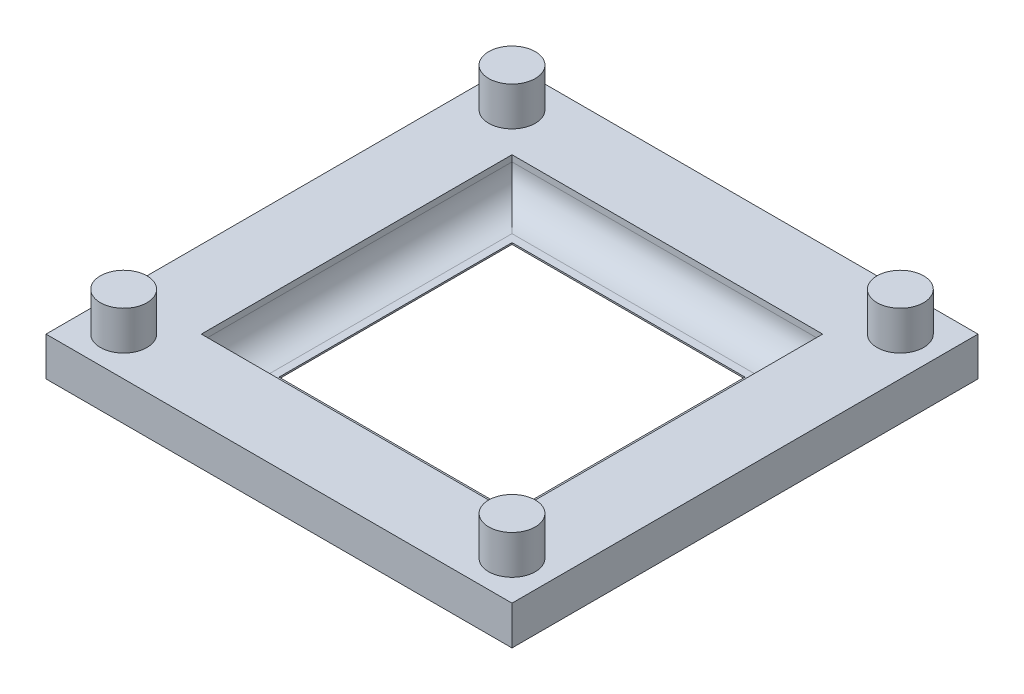
ISO-10303-21;
HEADER;
FILE_DESCRIPTION(('STEP AP214'),'2;1');
FILE_NAME('part.step','',(''),(''),'','','');
FILE_SCHEMA(('AUTOMOTIVE_DESIGN { 1 0 10303 214 1 1 1 1 }'));
ENDSEC;
DATA;
#1=APPLICATION_CONTEXT('core data for automotive mechanical design processes');
#2=APPLICATION_PROTOCOL_DEFINITION('international standard','automotive_design',2000,#1);
#3=PRODUCT_CONTEXT('',#1,'mechanical');
#4=PRODUCT('Part','Part','',(#3));
#5=PRODUCT_RELATED_PRODUCT_CATEGORY('part','',(#4));
#6=PRODUCT_DEFINITION_FORMATION('','',#4);
#7=PRODUCT_DEFINITION_CONTEXT('part definition',#1,'design');
#8=PRODUCT_DEFINITION('design','',#6,#7);
#9=PRODUCT_DEFINITION_SHAPE('','',#8);
#10=(LENGTH_UNIT() NAMED_UNIT(*) SI_UNIT(.MILLI.,.METRE.));
#11=(NAMED_UNIT(*) PLANE_ANGLE_UNIT() SI_UNIT($,.RADIAN.));
#12=(NAMED_UNIT(*) SI_UNIT($,.STERADIAN.) SOLID_ANGLE_UNIT());
#13=UNCERTAINTY_MEASURE_WITH_UNIT(LENGTH_MEASURE(1.E-05),#10,'distance_accuracy_value','');
#14=(GEOMETRIC_REPRESENTATION_CONTEXT(3) GLOBAL_UNCERTAINTY_ASSIGNED_CONTEXT((#13)) GLOBAL_UNIT_ASSIGNED_CONTEXT((#10,
#11,#12)) REPRESENTATION_CONTEXT('',''));
#15=CARTESIAN_POINT('',(0.,0.,0.));
#16=DIRECTION('',(0.,0.,1.));
#17=DIRECTION('',(1.,0.,0.));
#18=AXIS2_PLACEMENT_3D('',#15,#16,#17);
#19=CARTESIAN_POINT('',(7.5,0.1,0.));
#20=DIRECTION('',(-1.,0.,0.));
#21=DIRECTION('',(0.,0.,1.));
#22=AXIS2_PLACEMENT_3D('',#19,#20,#21);
#23=PLANE('',#22);
#24=DIRECTION('',(0.,0.,-1.));
#25=VECTOR('',#24,1.);
#26=CARTESIAN_POINT('',(7.5,0.,0.));
#27=LINE('',#26,#25);
#28=CARTESIAN_POINT('',(7.5,0.,7.5));
#29=VERTEX_POINT('',#28);
#30=CARTESIAN_POINT('',(7.5,0.,-7.5));
#31=VERTEX_POINT('',#30);
#32=EDGE_CURVE('E205',#29,#31,#27,.T.);
#33=ORIENTED_EDGE('',*,*,#32,.F.);
#34=DIRECTION('',(0.,-1.,0.));
#35=VECTOR('',#34,1.);
#36=CARTESIAN_POINT('',(7.5,0.1,7.5));
#37=LINE('',#36,#35);
#38=CARTESIAN_POINT('',(7.5,0.1,7.5));
#39=VERTEX_POINT('',#38);
#40=EDGE_CURVE('E237',#39,#29,#37,.T.);
#41=ORIENTED_EDGE('',*,*,#40,.F.);
#42=DIRECTION('',(0.,0.,-1.));
#43=VECTOR('',#42,1.);
#44=CARTESIAN_POINT('',(7.5,0.1,0.));
#45=LINE('',#44,#43);
#46=CARTESIAN_POINT('',(7.5,0.1,-7.5));
#47=VERTEX_POINT('',#46);
#48=EDGE_CURVE('E210',#39,#47,#45,.T.);
#49=ORIENTED_EDGE('',*,*,#48,.T.);
#50=DIRECTION('',(0.,-1.,0.));
#51=VECTOR('',#50,1.);
#52=CARTESIAN_POINT('',(7.5,0.1,-7.5));
#53=LINE('',#52,#51);
#54=EDGE_CURVE('E221',#47,#31,#53,.T.);
#55=ORIENTED_EDGE('',*,*,#54,.T.);
#56=EDGE_LOOP('',(#33,#41,#49,#55));
#57=FACE_BOUND('',#56,.T.);
#58=ADVANCED_FACE('F41',(#57),#23,.T.);
#59=CARTESIAN_POINT('',(0.,0.1,7.5));
#60=DIRECTION('',(0.,0.,-1.));
#61=DIRECTION('',(-1.,0.,0.));
#62=AXIS2_PLACEMENT_3D('',#59,#60,#61);
#63=PLANE('',#62);
#64=DIRECTION('',(1.,0.,0.));
#65=VECTOR('',#64,1.);
#66=CARTESIAN_POINT('',(0.,0.,7.5));
#67=LINE('',#66,#65);
#68=CARTESIAN_POINT('',(-7.5,0.,7.5));
#69=VERTEX_POINT('',#68);
#70=EDGE_CURVE('E224',#69,#29,#67,.T.);
#71=ORIENTED_EDGE('',*,*,#70,.F.);
#72=DIRECTION('',(0.,-1.,0.));
#73=VECTOR('',#72,1.);
#74=CARTESIAN_POINT('',(-7.5,0.1,7.5));
#75=LINE('',#74,#73);
#76=CARTESIAN_POINT('',(-7.5,0.1,7.5));
#77=VERTEX_POINT('',#76);
#78=EDGE_CURVE('E235',#77,#69,#75,.T.);
#79=ORIENTED_EDGE('',*,*,#78,.F.);
#80=DIRECTION('',(1.,0.,0.));
#81=VECTOR('',#80,1.);
#82=CARTESIAN_POINT('',(0.,0.1,7.5));
#83=LINE('',#82,#81);
#84=EDGE_CURVE('E213',#77,#39,#83,.T.);
#85=ORIENTED_EDGE('',*,*,#84,.T.);
#86=ORIENTED_EDGE('',*,*,#40,.T.);
#87=EDGE_LOOP('',(#71,#79,#85,#86));
#88=FACE_BOUND('',#87,.T.);
#89=ADVANCED_FACE('F289',(#88),#63,.T.);
#90=CARTESIAN_POINT('',(-7.5,0.1,0.));
#91=DIRECTION('',(-1.,0.,0.));
#92=DIRECTION('',(0.,0.,1.));
#93=AXIS2_PLACEMENT_3D('',#90,#91,#92);
#94=PLANE('',#93);
#95=DIRECTION('',(0.,0.,-1.));
#96=VECTOR('',#95,1.);
#97=CARTESIAN_POINT('',(-7.5,0.,0.));
#98=LINE('',#97,#96);
#99=CARTESIAN_POINT('',(-7.5,0.,-7.5));
#100=VERTEX_POINT('',#99);
#101=EDGE_CURVE('E227',#69,#100,#98,.T.);
#102=ORIENTED_EDGE('',*,*,#101,.T.);
#103=DIRECTION('',(0.,-1.,0.));
#104=VECTOR('',#103,1.);
#105=CARTESIAN_POINT('',(-7.5,0.1,-7.5));
#106=LINE('',#105,#104);
#107=CARTESIAN_POINT('',(-7.5,0.1,-7.5));
#108=VERTEX_POINT('',#107);
#109=EDGE_CURVE('E232',#108,#100,#106,.T.);
#110=ORIENTED_EDGE('',*,*,#109,.F.);
#111=DIRECTION('',(0.,0.,-1.));
#112=VECTOR('',#111,1.);
#113=CARTESIAN_POINT('',(-7.5,0.1,0.));
#114=LINE('',#113,#112);
#115=EDGE_CURVE('E217',#77,#108,#114,.T.);
#116=ORIENTED_EDGE('',*,*,#115,.F.);
#117=ORIENTED_EDGE('',*,*,#78,.T.);
#118=EDGE_LOOP('',(#102,#110,#116,#117));
#119=FACE_BOUND('',#118,.T.);
#120=ADVANCED_FACE('F295',(#119),#94,.F.);
#121=CARTESIAN_POINT('',(0.,0.1,-7.5));
#122=DIRECTION('',(0.,0.,-1.));
#123=DIRECTION('',(-1.,0.,0.));
#124=AXIS2_PLACEMENT_3D('',#121,#122,#123);
#125=PLANE('',#124);
#126=DIRECTION('',(1.,0.,0.));
#127=VECTOR('',#126,1.);
#128=CARTESIAN_POINT('',(0.,0.,-7.5));
#129=LINE('',#128,#127);
#130=EDGE_CURVE('E214',#100,#31,#129,.T.);
#131=ORIENTED_EDGE('',*,*,#130,.T.);
#132=ORIENTED_EDGE('',*,*,#54,.F.);
#133=DIRECTION('',(1.,0.,0.));
#134=VECTOR('',#133,1.);
#135=CARTESIAN_POINT('',(0.,0.1,-7.5));
#136=LINE('',#135,#134);
#137=EDGE_CURVE('E219',#108,#47,#136,.T.);
#138=ORIENTED_EDGE('',*,*,#137,.F.);
#139=ORIENTED_EDGE('',*,*,#109,.T.);
#140=EDGE_LOOP('',(#131,#132,#138,#139));
#141=FACE_BOUND('',#140,.T.);
#142=ADVANCED_FACE('F351',(#141),#125,.F.);
#143=CARTESIAN_POINT('',(0.,0.1,0.));
#144=DIRECTION('',(0.,1.,0.));
#145=DIRECTION('',(0.,0.,1.));
#146=AXIS2_PLACEMENT_3D('',#143,#144,#145);
#147=PLANE('',#146);
#148=DIRECTION('',(1.,0.,0.));
#149=VECTOR('',#148,1.);
#150=CARTESIAN_POINT('',(10.,0.1,8.));
#151=LINE('',#150,#149);
#152=CARTESIAN_POINT('',(-8.,0.1,8.));
#153=VERTEX_POINT('',#152);
#154=CARTESIAN_POINT('',(8.,0.1,8.));
#155=VERTEX_POINT('',#154);
#156=EDGE_CURVE('E243',#153,#155,#151,.T.);
#157=ORIENTED_EDGE('',*,*,#156,.T.);
#158=DIRECTION('',(0.,0.,-1.));
#159=VECTOR('',#158,1.);
#160=CARTESIAN_POINT('',(8.,0.1,-10.));
#161=LINE('',#160,#159);
#162=CARTESIAN_POINT('',(8.,0.1,-8.));
#163=VERTEX_POINT('',#162);
#164=EDGE_CURVE('E246',#155,#163,#161,.T.);
#165=ORIENTED_EDGE('',*,*,#164,.T.);
#166=DIRECTION('',(1.,0.,0.));
#167=VECTOR('',#166,1.);
#168=CARTESIAN_POINT('',(0.,0.1,-8.));
#169=LINE('',#168,#167);
#170=CARTESIAN_POINT('',(-8.,0.1,-8.));
#171=VERTEX_POINT('',#170);
#172=EDGE_CURVE('E241',#163,#171,#169,.F.);
#173=ORIENTED_EDGE('',*,*,#172,.T.);
#174=DIRECTION('',(0.,0.,-1.));
#175=VECTOR('',#174,1.);
#176=CARTESIAN_POINT('',(-8.,0.1,0.));
#177=LINE('',#176,#175);
#178=EDGE_CURVE('E239',#171,#153,#177,.F.);
#179=ORIENTED_EDGE('',*,*,#178,.T.);
#180=EDGE_LOOP('',(#157,#165,#173,#179));
#181=FACE_BOUND('',#180,.T.);
#182=ORIENTED_EDGE('',*,*,#48,.F.);
#183=ORIENTED_EDGE('',*,*,#84,.F.);
#184=ORIENTED_EDGE('',*,*,#115,.T.);
#185=ORIENTED_EDGE('',*,*,#137,.T.);
#186=EDGE_LOOP('',(#182,#183,#184,#185));
#187=FACE_BOUND('',#186,.T.);
#188=ADVANCED_FACE('F335',(#181,#187),#147,.T.);
#189=CARTESIAN_POINT('',(0.,0.,0.));
#190=DIRECTION('',(0.,1.,0.));
#191=DIRECTION('',(0.,0.,1.));
#192=AXIS2_PLACEMENT_3D('',#189,#190,#191);
#193=PLANE('',#192);
#194=ORIENTED_EDGE('',*,*,#32,.T.);
#195=ORIENTED_EDGE('',*,*,#130,.F.);
#196=ORIENTED_EDGE('',*,*,#101,.F.);
#197=ORIENTED_EDGE('',*,*,#70,.T.);
#198=EDGE_LOOP('',(#194,#195,#196,#197));
#199=FACE_BOUND('',#198,.T.);
#200=DIRECTION('',(1.,0.,0.));
#201=VECTOR('',#200,1.);
#202=CARTESIAN_POINT('',(0.,0.,15.));
#203=LINE('',#202,#201);
#204=CARTESIAN_POINT('',(-15.,0.,15.));
#205=VERTEX_POINT('',#204);
#206=CARTESIAN_POINT('',(15.,0.,15.));
#207=VERTEX_POINT('',#206);
#208=EDGE_CURVE('E186',#205,#207,#203,.T.);
#209=ORIENTED_EDGE('',*,*,#208,.F.);
#210=DIRECTION('',(0.,0.,-1.));
#211=VECTOR('',#210,1.);
#212=CARTESIAN_POINT('',(-15.,0.,0.));
#213=LINE('',#212,#211);
#214=CARTESIAN_POINT('',(-15.,0.,-15.));
#215=VERTEX_POINT('',#214);
#216=EDGE_CURVE('E164',#205,#215,#213,.T.);
#217=ORIENTED_EDGE('',*,*,#216,.T.);
#218=DIRECTION('',(1.,0.,0.));
#219=VECTOR('',#218,1.);
#220=CARTESIAN_POINT('',(0.,0.,-15.));
#221=LINE('',#220,#219);
#222=CARTESIAN_POINT('',(15.,0.,-15.));
#223=VERTEX_POINT('',#222);
#224=EDGE_CURVE('E192',#215,#223,#221,.T.);
#225=ORIENTED_EDGE('',*,*,#224,.T.);
#226=DIRECTION('',(0.,0.,-1.));
#227=VECTOR('',#226,1.);
#228=CARTESIAN_POINT('',(15.,0.,0.));
#229=LINE('',#228,#227);
#230=EDGE_CURVE('E189',#207,#223,#229,.T.);
#231=ORIENTED_EDGE('',*,*,#230,.F.);
#232=EDGE_LOOP('',(#209,#217,#225,#231));
#233=FACE_BOUND('',#232,.T.);
#234=ADVANCED_FACE('F330',(#199,#233),#193,.F.);
#235=CARTESIAN_POINT('',(0.,2.5,15.));
#236=DIRECTION('',(0.,0.,-1.));
#237=DIRECTION('',(-1.,0.,0.));
#238=AXIS2_PLACEMENT_3D('',#235,#236,#237);
#239=PLANE('',#238);
#240=ORIENTED_EDGE('',*,*,#208,.T.);
#241=DIRECTION('',(0.,-1.,0.));
#242=VECTOR('',#241,1.);
#243=CARTESIAN_POINT('',(15.,2.5,15.));
#244=LINE('',#243,#242);
#245=CARTESIAN_POINT('',(15.,2.5,15.));
#246=VERTEX_POINT('',#245);
#247=EDGE_CURVE('E202',#246,#207,#244,.T.);
#248=ORIENTED_EDGE('',*,*,#247,.F.);
#249=DIRECTION('',(1.,0.,0.));
#250=VECTOR('',#249,1.);
#251=CARTESIAN_POINT('',(0.,2.5,15.));
#252=LINE('',#251,#250);
#253=CARTESIAN_POINT('',(-15.,2.5,15.));
#254=VERTEX_POINT('',#253);
#255=EDGE_CURVE('E174',#254,#246,#252,.T.);
#256=ORIENTED_EDGE('',*,*,#255,.F.);
#257=DIRECTION('',(0.,-1.,0.));
#258=VECTOR('',#257,1.);
#259=CARTESIAN_POINT('',(-15.,2.5,15.));
#260=LINE('',#259,#258);
#261=EDGE_CURVE('E154',#254,#205,#260,.T.);
#262=ORIENTED_EDGE('',*,*,#261,.T.);
#263=EDGE_LOOP('',(#240,#248,#256,#262));
#264=FACE_BOUND('',#263,.T.);
#265=ADVANCED_FACE('F327',(#264),#239,.F.);
#266=CARTESIAN_POINT('',(15.,2.5,0.));
#267=DIRECTION('',(-1.,0.,0.));
#268=DIRECTION('',(0.,0.,1.));
#269=AXIS2_PLACEMENT_3D('',#266,#267,#268);
#270=PLANE('',#269);
#271=ORIENTED_EDGE('',*,*,#230,.T.);
#272=DIRECTION('',(0.,-1.,0.));
#273=VECTOR('',#272,1.);
#274=CARTESIAN_POINT('',(15.,2.5,-15.));
#275=LINE('',#274,#273);
#276=CARTESIAN_POINT('',(15.,2.5,-15.));
#277=VERTEX_POINT('',#276);
#278=EDGE_CURVE('E200',#277,#223,#275,.T.);
#279=ORIENTED_EDGE('',*,*,#278,.F.);
#280=DIRECTION('',(0.,0.,-1.));
#281=VECTOR('',#280,1.);
#282=CARTESIAN_POINT('',(15.,2.5,0.));
#283=LINE('',#282,#281);
#284=EDGE_CURVE('E177',#246,#277,#283,.T.);
#285=ORIENTED_EDGE('',*,*,#284,.F.);
#286=ORIENTED_EDGE('',*,*,#247,.T.);
#287=EDGE_LOOP('',(#271,#279,#285,#286));
#288=FACE_BOUND('',#287,.T.);
#289=ADVANCED_FACE('F324',(#288),#270,.F.);
#290=CARTESIAN_POINT('',(0.,2.5,-15.));
#291=DIRECTION('',(0.,0.,-1.));
#292=DIRECTION('',(-1.,0.,0.));
#293=AXIS2_PLACEMENT_3D('',#290,#291,#292);
#294=PLANE('',#293);
#295=ORIENTED_EDGE('',*,*,#224,.F.);
#296=DIRECTION('',(0.,-1.,0.));
#297=VECTOR('',#296,1.);
#298=CARTESIAN_POINT('',(-15.,2.5,-15.));
#299=LINE('',#298,#297);
#300=CARTESIAN_POINT('',(-15.,2.5,-15.));
#301=VERTEX_POINT('',#300);
#302=EDGE_CURVE('E198',#301,#215,#299,.T.);
#303=ORIENTED_EDGE('',*,*,#302,.F.);
#304=DIRECTION('',(1.,0.,0.));
#305=VECTOR('',#304,1.);
#306=CARTESIAN_POINT('',(0.,2.5,-15.));
#307=LINE('',#306,#305);
#308=EDGE_CURVE('E179',#301,#277,#307,.T.);
#309=ORIENTED_EDGE('',*,*,#308,.T.);
#310=ORIENTED_EDGE('',*,*,#278,.T.);
#311=EDGE_LOOP('',(#295,#303,#309,#310));
#312=FACE_BOUND('',#311,.T.);
#313=ADVANCED_FACE('F321',(#312),#294,.T.);
#314=CARTESIAN_POINT('',(10.,2.5,0.));
#315=DIRECTION('',(-1.,0.,0.));
#316=DIRECTION('',(0.,0.,1.));
#317=AXIS2_PLACEMENT_3D('',#314,#315,#316);
#318=PLANE('',#317);
#319=DIRECTION('',(0.,-1.,0.));
#320=VECTOR('',#319,1.);
#321=CARTESIAN_POINT('',(10.,2.5,-10.));
#322=LINE('',#321,#320);
#323=CARTESIAN_POINT('',(10.,2.5,-10.));
#324=VERTEX_POINT('',#323);
#325=CARTESIAN_POINT('',(10.,2.1,-10.));
#326=VERTEX_POINT('',#325);
#327=EDGE_CURVE('E185',#324,#326,#322,.T.);
#328=ORIENTED_EDGE('',*,*,#327,.T.);
#329=DIRECTION('',(0.,0.,-1.));
#330=VECTOR('',#329,1.);
#331=CARTESIAN_POINT('',(10.,2.1,10.));
#332=LINE('',#331,#330);
#333=CARTESIAN_POINT('',(10.,2.1,10.));
#334=VERTEX_POINT('',#333);
#335=EDGE_CURVE('E50',#326,#334,#332,.F.);
#336=ORIENTED_EDGE('',*,*,#335,.T.);
#337=DIRECTION('',(0.,-1.,0.));
#338=VECTOR('',#337,1.);
#339=CARTESIAN_POINT('',(10.,2.5,10.));
#340=LINE('',#339,#338);
#341=CARTESIAN_POINT('',(10.,2.5,10.));
#342=VERTEX_POINT('',#341);
#343=EDGE_CURVE('E145',#342,#334,#340,.T.);
#344=ORIENTED_EDGE('',*,*,#343,.F.);
#345=DIRECTION('',(0.,0.,-1.));
#346=VECTOR('',#345,1.);
#347=CARTESIAN_POINT('',(10.,2.5,0.));
#348=LINE('',#347,#346);
#349=EDGE_CURVE('E148',#342,#324,#348,.T.);
#350=ORIENTED_EDGE('',*,*,#349,.T.);
#351=EDGE_LOOP('',(#328,#336,#344,#350));
#352=FACE_BOUND('',#351,.T.);
#353=ADVANCED_FACE('F147',(#352),#318,.T.);
#354=CARTESIAN_POINT('',(0.,2.5,10.));
#355=DIRECTION('',(0.,0.,-1.));
#356=DIRECTION('',(-1.,0.,0.));
#357=AXIS2_PLACEMENT_3D('',#354,#355,#356);
#358=PLANE('',#357);
#359=ORIENTED_EDGE('',*,*,#343,.T.);
#360=DIRECTION('',(1.,0.,0.));
#361=VECTOR('',#360,1.);
#362=CARTESIAN_POINT('',(-10.,2.1,10.));
#363=LINE('',#362,#361);
#364=CARTESIAN_POINT('',(-10.,2.1,10.));
#365=VERTEX_POINT('',#364);
#366=EDGE_CURVE('E248',#334,#365,#363,.F.);
#367=ORIENTED_EDGE('',*,*,#366,.T.);
#368=DIRECTION('',(0.,-1.,0.));
#369=VECTOR('',#368,1.);
#370=CARTESIAN_POINT('',(-10.,2.5,10.));
#371=LINE('',#370,#369);
#372=CARTESIAN_POINT('',(-10.,2.5,10.));
#373=VERTEX_POINT('',#372);
#374=EDGE_CURVE('E155',#373,#365,#371,.T.);
#375=ORIENTED_EDGE('',*,*,#374,.F.);
#376=DIRECTION('',(1.,0.,0.));
#377=VECTOR('',#376,1.);
#378=CARTESIAN_POINT('',(0.,2.5,10.));
#379=LINE('',#378,#377);
#380=EDGE_CURVE('E161',#373,#342,#379,.T.);
#381=ORIENTED_EDGE('',*,*,#380,.T.);
#382=EDGE_LOOP('',(#359,#367,#375,#381));
#383=FACE_BOUND('',#382,.T.);
#384=ADVANCED_FACE('F166',(#383),#358,.T.);
#385=CARTESIAN_POINT('',(-10.,2.5,0.));
#386=DIRECTION('',(-1.,0.,0.));
#387=DIRECTION('',(0.,0.,1.));
#388=AXIS2_PLACEMENT_3D('',#385,#386,#387);
#389=PLANE('',#388);
#390=ORIENTED_EDGE('',*,*,#374,.T.);
#391=DIRECTION('',(0.,0.,-1.));
#392=VECTOR('',#391,1.);
#393=CARTESIAN_POINT('',(-10.,2.1,0.));
#394=LINE('',#393,#392);
#395=CARTESIAN_POINT('',(-10.,2.1,-10.));
#396=VERTEX_POINT('',#395);
#397=EDGE_CURVE('E11',#365,#396,#394,.T.);
#398=ORIENTED_EDGE('',*,*,#397,.T.);
#399=DIRECTION('',(0.,-1.,0.));
#400=VECTOR('',#399,1.);
#401=CARTESIAN_POINT('',(-10.,2.5,-10.));
#402=LINE('',#401,#400);
#403=CARTESIAN_POINT('',(-10.,2.5,-10.));
#404=VERTEX_POINT('',#403);
#405=EDGE_CURVE('E207',#404,#396,#402,.T.);
#406=ORIENTED_EDGE('',*,*,#405,.F.);
#407=DIRECTION('',(0.,0.,-1.));
#408=VECTOR('',#407,1.);
#409=CARTESIAN_POINT('',(-10.,2.5,0.));
#410=LINE('',#409,#408);
#411=EDGE_CURVE('E168',#373,#404,#410,.T.);
#412=ORIENTED_EDGE('',*,*,#411,.F.);
#413=EDGE_LOOP('',(#390,#398,#406,#412));
#414=FACE_BOUND('',#413,.T.);
#415=ADVANCED_FACE('F274',(#414),#389,.F.);
#416=CARTESIAN_POINT('',(0.,2.5,-10.));
#417=DIRECTION('',(0.,0.,-1.));
#418=DIRECTION('',(-1.,0.,0.));
#419=AXIS2_PLACEMENT_3D('',#416,#417,#418);
#420=PLANE('',#419);
#421=ORIENTED_EDGE('',*,*,#405,.T.);
#422=DIRECTION('',(1.,0.,0.));
#423=VECTOR('',#422,1.);
#424=CARTESIAN_POINT('',(0.,2.1,-10.));
#425=LINE('',#424,#423);
#426=EDGE_CURVE('E63',#396,#326,#425,.T.);
#427=ORIENTED_EDGE('',*,*,#426,.T.);
#428=ORIENTED_EDGE('',*,*,#327,.F.);
#429=DIRECTION('',(1.,0.,0.));
#430=VECTOR('',#429,1.);
#431=CARTESIAN_POINT('',(0.,2.5,-10.));
#432=LINE('',#431,#430);
#433=EDGE_CURVE('E163',#404,#324,#432,.T.);
#434=ORIENTED_EDGE('',*,*,#433,.F.);
#435=EDGE_LOOP('',(#421,#427,#428,#434));
#436=FACE_BOUND('',#435,.T.);
#437=ADVANCED_FACE('F275',(#436),#420,.F.);
#438=CARTESIAN_POINT('',(-15.,2.5,0.));
#439=DIRECTION('',(-1.,0.,0.));
#440=DIRECTION('',(0.,0.,1.));
#441=AXIS2_PLACEMENT_3D('',#438,#439,#440);
#442=PLANE('',#441);
#443=ORIENTED_EDGE('',*,*,#216,.F.);
#444=ORIENTED_EDGE('',*,*,#261,.F.);
#445=DIRECTION('',(0.,0.,-1.));
#446=VECTOR('',#445,1.);
#447=CARTESIAN_POINT('',(-15.,2.5,0.));
#448=LINE('',#447,#446);
#449=EDGE_CURVE('E182',#254,#301,#448,.T.);
#450=ORIENTED_EDGE('',*,*,#449,.T.);
#451=ORIENTED_EDGE('',*,*,#302,.T.);
#452=EDGE_LOOP('',(#443,#444,#450,#451));
#453=FACE_BOUND('',#452,.T.);
#454=ADVANCED_FACE('F277',(#453),#442,.T.);
#455=CARTESIAN_POINT('',(0.,2.5,0.));
#456=DIRECTION('',(0.,1.,0.));
#457=DIRECTION('',(0.,0.,1.));
#458=AXIS2_PLACEMENT_3D('',#455,#456,#457);
#459=PLANE('',#458);
#460=CARTESIAN_POINT('',(-12.5,2.5,12.5));
#461=DIRECTION('',(0.,1.,0.));
#462=DIRECTION('',(0.,0.,1.));
#463=AXIS2_PLACEMENT_3D('',#460,#461,#462);
#464=CIRCLE('',#463,1.5);
#465=CARTESIAN_POINT('',(-12.5,2.5,14.));
#466=VERTEX_POINT('',#465);
#467=EDGE_CURVE('E558',#466,#466,#464,.T.);
#468=ORIENTED_EDGE('',*,*,#467,.F.);
#469=EDGE_LOOP('',(#468));
#470=FACE_BOUND('',#469,.T.);
#471=CARTESIAN_POINT('',(-12.5,2.5,-12.5));
#472=DIRECTION('',(0.,1.,0.));
#473=DIRECTION('',(0.,0.,1.));
#474=AXIS2_PLACEMENT_3D('',#471,#472,#473);
#475=CIRCLE('',#474,1.5);
#476=CARTESIAN_POINT('',(-12.5,2.5,-11.));
#477=VERTEX_POINT('',#476);
#478=EDGE_CURVE('E557',#477,#477,#475,.T.);
#479=ORIENTED_EDGE('',*,*,#478,.F.);
#480=EDGE_LOOP('',(#479));
#481=FACE_BOUND('',#480,.T.);
#482=CARTESIAN_POINT('',(12.5,2.5,-12.5));
#483=DIRECTION('',(0.,1.,0.));
#484=DIRECTION('',(0.,0.,1.));
#485=AXIS2_PLACEMENT_3D('',#482,#483,#484);
#486=CIRCLE('',#485,1.5);
#487=CARTESIAN_POINT('',(12.5,2.5,-11.));
#488=VERTEX_POINT('',#487);
#489=EDGE_CURVE('E567',#488,#488,#486,.T.);
#490=ORIENTED_EDGE('',*,*,#489,.F.);
#491=EDGE_LOOP('',(#490));
#492=FACE_BOUND('',#491,.T.);
#493=CARTESIAN_POINT('',(12.5,2.5,12.5));
#494=DIRECTION('',(0.,1.,0.));
#495=DIRECTION('',(0.,0.,1.));
#496=AXIS2_PLACEMENT_3D('',#493,#494,#495);
#497=CIRCLE('',#496,1.5);
#498=CARTESIAN_POINT('',(12.5,2.5,14.));
#499=VERTEX_POINT('',#498);
#500=EDGE_CURVE('E572',#499,#499,#497,.T.);
#501=ORIENTED_EDGE('',*,*,#500,.F.);
#502=EDGE_LOOP('',(#501));
#503=FACE_BOUND('',#502,.T.);
#504=ORIENTED_EDGE('',*,*,#349,.F.);
#505=ORIENTED_EDGE('',*,*,#380,.F.);
#506=ORIENTED_EDGE('',*,*,#411,.T.);
#507=ORIENTED_EDGE('',*,*,#433,.T.);
#508=EDGE_LOOP('',(#504,#505,#506,#507));
#509=FACE_BOUND('',#508,.T.);
#510=ORIENTED_EDGE('',*,*,#255,.T.);
#511=ORIENTED_EDGE('',*,*,#284,.T.);
#512=ORIENTED_EDGE('',*,*,#308,.F.);
#513=ORIENTED_EDGE('',*,*,#449,.F.);
#514=EDGE_LOOP('',(#510,#511,#512,#513));
#515=FACE_BOUND('',#514,.T.);
#516=ADVANCED_FACE('F159',(#470,#481,#492,#503,#509,#515),#459,.T.);
#517=CARTESIAN_POINT('',(0.,2.1,-8.));
#518=DIRECTION('',(1.,0.,0.));
#519=DIRECTION('',(0.,0.,-1.));
#520=AXIS2_PLACEMENT_3D('',#517,#518,#519);
#521=CYLINDRICAL_SURFACE('',#520,2.);
#522=CARTESIAN_POINT('',(8.,2.1,-8.));
#523=DIRECTION('',(0.707106781186547,0.,0.707106781186547));
#524=DIRECTION('',(0.707106781186547,0.,-0.707106781186547));
#525=AXIS2_PLACEMENT_3D('',#522,#523,#524);
#526=ELLIPSE('',#525,2.82842712474619,2.);
#527=EDGE_CURVE('E256',#326,#163,#526,.F.);
#528=ORIENTED_EDGE('',*,*,#527,.F.);
#529=ORIENTED_EDGE('',*,*,#426,.F.);
#530=CARTESIAN_POINT('',(-8.,2.1,-8.));
#531=DIRECTION('',(0.707106781186547,0.,-0.707106781186547));
#532=DIRECTION('',(0.707106781186547,0.,0.707106781186547));
#533=AXIS2_PLACEMENT_3D('',#530,#531,#532);
#534=ELLIPSE('',#533,2.82842712474619,2.);
#535=EDGE_CURVE('E45',#171,#396,#534,.T.);
#536=ORIENTED_EDGE('',*,*,#535,.F.);
#537=ORIENTED_EDGE('',*,*,#172,.F.);
#538=EDGE_LOOP('',(#528,#529,#536,#537));
#539=FACE_BOUND('',#538,.T.);
#540=ADVANCED_FACE('F43',(#539),#521,.F.);
#541=CARTESIAN_POINT('',(-8.,2.1,0.));
#542=DIRECTION('',(0.,0.,-1.));
#543=DIRECTION('',(-1.,0.,0.));
#544=AXIS2_PLACEMENT_3D('',#541,#542,#543);
#545=CYLINDRICAL_SURFACE('',#544,2.);
#546=ORIENTED_EDGE('',*,*,#535,.T.);
#547=ORIENTED_EDGE('',*,*,#397,.F.);
#548=CARTESIAN_POINT('',(-8.,2.1,8.));
#549=DIRECTION('',(-0.707106781186547,0.,-0.707106781186547));
#550=DIRECTION('',(-0.707106781186547,0.,0.707106781186547));
#551=AXIS2_PLACEMENT_3D('',#548,#549,#550);
#552=ELLIPSE('',#551,2.82842712474619,2.);
#553=EDGE_CURVE('E254',#153,#365,#552,.T.);
#554=ORIENTED_EDGE('',*,*,#553,.F.);
#555=ORIENTED_EDGE('',*,*,#178,.F.);
#556=EDGE_LOOP('',(#546,#547,#554,#555));
#557=FACE_BOUND('',#556,.T.);
#558=ADVANCED_FACE('F265',(#557),#545,.F.);
#559=CARTESIAN_POINT('',(8.,2.1,0.));
#560=DIRECTION('',(0.,0.,1.));
#561=DIRECTION('',(1.,0.,0.));
#562=AXIS2_PLACEMENT_3D('',#559,#560,#561);
#563=CYLINDRICAL_SURFACE('',#562,2.);
#564=ORIENTED_EDGE('',*,*,#527,.T.);
#565=ORIENTED_EDGE('',*,*,#164,.F.);
#566=CARTESIAN_POINT('',(8.,2.1,8.));
#567=DIRECTION('',(-0.707106781186547,0.,0.707106781186547));
#568=DIRECTION('',(-0.707106781186547,0.,-0.707106781186547));
#569=AXIS2_PLACEMENT_3D('',#566,#567,#568);
#570=ELLIPSE('',#569,2.82842712474619,2.);
#571=EDGE_CURVE('E252',#334,#155,#570,.F.);
#572=ORIENTED_EDGE('',*,*,#571,.F.);
#573=ORIENTED_EDGE('',*,*,#335,.F.);
#574=EDGE_LOOP('',(#564,#565,#572,#573));
#575=FACE_BOUND('',#574,.T.);
#576=ADVANCED_FACE('F270',(#575),#563,.F.);
#577=CARTESIAN_POINT('',(0.,2.1,8.));
#578=DIRECTION('',(-1.,0.,0.));
#579=DIRECTION('',(0.,0.,1.));
#580=AXIS2_PLACEMENT_3D('',#577,#578,#579);
#581=CYLINDRICAL_SURFACE('',#580,2.);
#582=ORIENTED_EDGE('',*,*,#553,.T.);
#583=ORIENTED_EDGE('',*,*,#366,.F.);
#584=ORIENTED_EDGE('',*,*,#571,.T.);
#585=ORIENTED_EDGE('',*,*,#156,.F.);
#586=EDGE_LOOP('',(#582,#583,#584,#585));
#587=FACE_BOUND('',#586,.T.);
#588=ADVANCED_FACE('F273',(#587),#581,.F.);
#589=CARTESIAN_POINT('',(12.5,5.,12.5));
#590=DIRECTION('',(0.,-1.,0.));
#591=DIRECTION('',(0.,0.,-1.));
#592=AXIS2_PLACEMENT_3D('',#589,#590,#591);
#593=CYLINDRICAL_SURFACE('',#592,1.5);
#594=CARTESIAN_POINT('',(12.5,5.,12.5));
#595=DIRECTION('',(0.,1.,0.));
#596=DIRECTION('',(0.,0.,1.));
#597=AXIS2_PLACEMENT_3D('',#594,#595,#596);
#598=CIRCLE('',#597,1.5);
#599=CARTESIAN_POINT('',(12.5,5.,14.));
#600=VERTEX_POINT('',#599);
#601=EDGE_CURVE('E255',#600,#600,#598,.T.);
#602=ORIENTED_EDGE('',*,*,#601,.F.);
#603=EDGE_LOOP('',(#602));
#604=FACE_BOUND('',#603,.T.);
#605=ORIENTED_EDGE('',*,*,#500,.T.);
#606=EDGE_LOOP('',(#605));
#607=FACE_BOUND('',#606,.T.);
#608=ADVANCED_FACE('F303',(#604,#607),#593,.T.);
#609=CARTESIAN_POINT('',(0.,5.,0.));
#610=DIRECTION('',(0.,1.,0.));
#611=DIRECTION('',(0.,0.,1.));
#612=AXIS2_PLACEMENT_3D('',#609,#610,#611);
#613=PLANE('',#612);
#614=ORIENTED_EDGE('',*,*,#601,.T.);
#615=EDGE_LOOP('',(#614));
#616=FACE_BOUND('',#615,.T.);
#617=ADVANCED_FACE('F471',(#616),#613,.T.);
#618=CARTESIAN_POINT('',(12.5,5.,-12.5));
#619=DIRECTION('',(0.,-1.,0.));
#620=DIRECTION('',(0.,0.,-1.));
#621=AXIS2_PLACEMENT_3D('',#618,#619,#620);
#622=CYLINDRICAL_SURFACE('',#621,1.5);
#623=CARTESIAN_POINT('',(12.5,5.,-12.5));
#624=DIRECTION('',(0.,1.,0.));
#625=DIRECTION('',(0.,0.,1.));
#626=AXIS2_PLACEMENT_3D('',#623,#624,#625);
#627=CIRCLE('',#626,1.5);
#628=CARTESIAN_POINT('',(12.5,5.,-11.));
#629=VERTEX_POINT('',#628);
#630=EDGE_CURVE('E569',#629,#629,#627,.T.);
#631=ORIENTED_EDGE('',*,*,#630,.F.);
#632=EDGE_LOOP('',(#631));
#633=FACE_BOUND('',#632,.T.);
#634=ORIENTED_EDGE('',*,*,#489,.T.);
#635=EDGE_LOOP('',(#634));
#636=FACE_BOUND('',#635,.T.);
#637=ADVANCED_FACE('F480',(#633,#636),#622,.T.);
#638=CARTESIAN_POINT('',(0.,5.,0.));
#639=DIRECTION('',(0.,1.,0.));
#640=DIRECTION('',(0.,0.,1.));
#641=AXIS2_PLACEMENT_3D('',#638,#639,#640);
#642=PLANE('',#641);
#643=ORIENTED_EDGE('',*,*,#630,.T.);
#644=EDGE_LOOP('',(#643));
#645=FACE_BOUND('',#644,.T.);
#646=ADVANCED_FACE('F492',(#645),#642,.T.);
#647=CARTESIAN_POINT('',(-12.5,5.,-12.5));
#648=DIRECTION('',(0.,-1.,0.));
#649=DIRECTION('',(0.,0.,-1.));
#650=AXIS2_PLACEMENT_3D('',#647,#648,#649);
#651=CYLINDRICAL_SURFACE('',#650,1.5);
#652=CARTESIAN_POINT('',(-12.5,5.,-12.5));
#653=DIRECTION('',(0.,1.,0.));
#654=DIRECTION('',(0.,0.,1.));
#655=AXIS2_PLACEMENT_3D('',#652,#653,#654);
#656=CIRCLE('',#655,1.5);
#657=CARTESIAN_POINT('',(-12.5,5.,-11.));
#658=VERTEX_POINT('',#657);
#659=EDGE_CURVE('E561',#658,#658,#656,.T.);
#660=ORIENTED_EDGE('',*,*,#659,.F.);
#661=EDGE_LOOP('',(#660));
#662=FACE_BOUND('',#661,.T.);
#663=ORIENTED_EDGE('',*,*,#478,.T.);
#664=EDGE_LOOP('',(#663));
#665=FACE_BOUND('',#664,.T.);
#666=ADVANCED_FACE('F502',(#662,#665),#651,.T.);
#667=CARTESIAN_POINT('',(0.,5.,0.));
#668=DIRECTION('',(0.,1.,0.));
#669=DIRECTION('',(0.,0.,1.));
#670=AXIS2_PLACEMENT_3D('',#667,#668,#669);
#671=PLANE('',#670);
#672=ORIENTED_EDGE('',*,*,#659,.T.);
#673=EDGE_LOOP('',(#672));
#674=FACE_BOUND('',#673,.T.);
#675=ADVANCED_FACE('F515',(#674),#671,.T.);
#676=CARTESIAN_POINT('',(-12.5,5.,12.5));
#677=DIRECTION('',(0.,-1.,0.));
#678=DIRECTION('',(0.,0.,-1.));
#679=AXIS2_PLACEMENT_3D('',#676,#677,#678);
#680=CYLINDRICAL_SURFACE('',#679,1.5);
#681=CARTESIAN_POINT('',(-12.5,5.,12.5));
#682=DIRECTION('',(0.,1.,0.));
#683=DIRECTION('',(0.,0.,1.));
#684=AXIS2_PLACEMENT_3D('',#681,#682,#683);
#685=CIRCLE('',#684,1.5);
#686=CARTESIAN_POINT('',(-12.5,5.,14.));
#687=VERTEX_POINT('',#686);
#688=EDGE_CURVE('E556',#687,#687,#685,.T.);
#689=ORIENTED_EDGE('',*,*,#688,.F.);
#690=EDGE_LOOP('',(#689));
#691=FACE_BOUND('',#690,.T.);
#692=ORIENTED_EDGE('',*,*,#467,.T.);
#693=EDGE_LOOP('',(#692));
#694=FACE_BOUND('',#693,.T.);
#695=ADVANCED_FACE('F525',(#691,#694),#680,.T.);
#696=CARTESIAN_POINT('',(0.,5.,0.));
#697=DIRECTION('',(0.,1.,0.));
#698=DIRECTION('',(0.,0.,1.));
#699=AXIS2_PLACEMENT_3D('',#696,#697,#698);
#700=PLANE('',#699);
#701=ORIENTED_EDGE('',*,*,#688,.T.);
#702=EDGE_LOOP('',(#701));
#703=FACE_BOUND('',#702,.T.);
#704=ADVANCED_FACE('F538',(#703),#700,.T.);
#705=CLOSED_SHELL('',(#58,#89,#120,#142,#188,#234,#265,#289,#313,#353,#384,#415,#437,#454,#516,
#540,#558,#576,#588,#608,#617,#637,#646,#666,#675,#695,#704));
#706=MANIFOLD_SOLID_BREP('B2',#705);
#707=ADVANCED_BREP_SHAPE_REPRESENTATION('',(#18,#706),#14);
#708=SHAPE_DEFINITION_REPRESENTATION(#9,#707);
ENDSEC;
END-ISO-10303-21;
